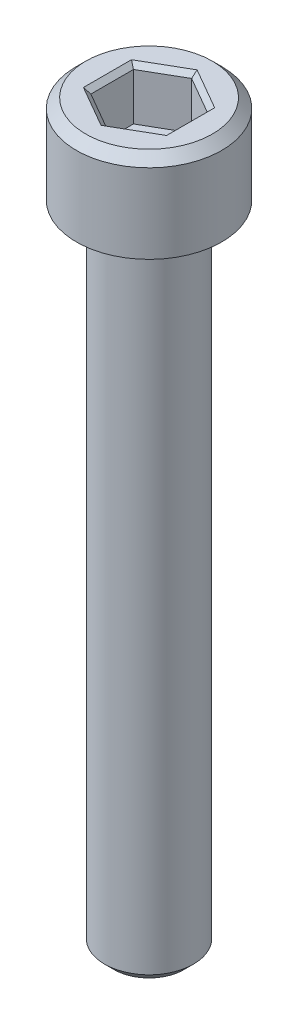
ISO-10303-21;
HEADER;
FILE_DESCRIPTION(('STEP AP214'),'2;1');
FILE_NAME('part.step','',(''),(''),'','','');
FILE_SCHEMA(('AUTOMOTIVE_DESIGN { 1 0 10303 214 1 1 1 1 }'));
ENDSEC;
DATA;
#1=APPLICATION_CONTEXT('core data for automotive mechanical design processes');
#2=APPLICATION_PROTOCOL_DEFINITION('international standard','automotive_design',2000,#1);
#3=PRODUCT_CONTEXT('',#1,'mechanical');
#4=PRODUCT('Part','Part','',(#3));
#5=PRODUCT_RELATED_PRODUCT_CATEGORY('part','',(#4));
#6=PRODUCT_DEFINITION_FORMATION('','',#4);
#7=PRODUCT_DEFINITION_CONTEXT('part definition',#1,'design');
#8=PRODUCT_DEFINITION('design','',#6,#7);
#9=PRODUCT_DEFINITION_SHAPE('','',#8);
#10=(LENGTH_UNIT() NAMED_UNIT(*) SI_UNIT(.MILLI.,.METRE.));
#11=(NAMED_UNIT(*) PLANE_ANGLE_UNIT() SI_UNIT($,.RADIAN.));
#12=(NAMED_UNIT(*) SI_UNIT($,.STERADIAN.) SOLID_ANGLE_UNIT());
#13=UNCERTAINTY_MEASURE_WITH_UNIT(LENGTH_MEASURE(1.E-05),#10,'distance_accuracy_value','');
#14=(GEOMETRIC_REPRESENTATION_CONTEXT(3) GLOBAL_UNCERTAINTY_ASSIGNED_CONTEXT((#13)) GLOBAL_UNIT_ASSIGNED_CONTEXT((#10,
#11,#12)) REPRESENTATION_CONTEXT('',''));
#15=CARTESIAN_POINT('',(0.,0.,0.));
#16=DIRECTION('',(0.,0.,1.));
#17=DIRECTION('',(1.,0.,0.));
#18=AXIS2_PLACEMENT_3D('',#15,#16,#17);
#19=CARTESIAN_POINT('',(-3.96874999999999,-2.794,0.));
#20=DIRECTION('',(0.,-1.,0.));
#21=DIRECTION('',(0.,0.,-1.));
#22=AXIS2_PLACEMENT_3D('',#19,#20,#21);
#23=PLANE('',#22);
#24=DIRECTION('',(-0.866025403784439,0.,0.5));
#25=VECTOR('',#24,1.);
#26=CARTESIAN_POINT('',(1.98437500000001,-2.794,1.14567944042317));
#27=LINE('',#26,#25);
#28=CARTESIAN_POINT('',(1.98437500000001,-2.794,1.14567944042317));
#29=VERTEX_POINT('',#28);
#30=CARTESIAN_POINT('',(0.,-2.794,2.29135888084634));
#31=VERTEX_POINT('',#30);
#32=EDGE_CURVE('E86',#29,#31,#27,.T.);
#33=ORIENTED_EDGE('',*,*,#32,.F.);
#34=DIRECTION('',(0.,0.,1.));
#35=VECTOR('',#34,1.);
#36=CARTESIAN_POINT('',(1.98437500000001,-2.794,-1.14567944042316));
#37=LINE('',#36,#35);
#38=CARTESIAN_POINT('',(1.98437500000001,-2.794,-1.14567944042316));
#39=VERTEX_POINT('',#38);
#40=EDGE_CURVE('E91',#39,#29,#37,.T.);
#41=ORIENTED_EDGE('',*,*,#40,.F.);
#42=DIRECTION('',(0.866025403784439,0.,0.5));
#43=VECTOR('',#42,1.);
#44=CARTESIAN_POINT('',(0.,-2.794,-2.29135888084632));
#45=LINE('',#44,#43);
#46=CARTESIAN_POINT('',(0.,-2.794,-2.29135888084632));
#47=VERTEX_POINT('',#46);
#48=EDGE_CURVE('E176',#47,#39,#45,.T.);
#49=ORIENTED_EDGE('',*,*,#48,.F.);
#50=DIRECTION('',(0.866025403784438,0.,-0.5));
#51=VECTOR('',#50,1.);
#52=CARTESIAN_POINT('',(-1.98437499999999,-2.794,-1.14567944042316));
#53=LINE('',#52,#51);
#54=CARTESIAN_POINT('',(-1.984375,-2.794,-1.14567944042316));
#55=VERTEX_POINT('',#54);
#56=EDGE_CURVE('E182',#55,#47,#53,.T.);
#57=ORIENTED_EDGE('',*,*,#56,.F.);
#58=DIRECTION('',(0.,0.,-1.));
#59=VECTOR('',#58,1.);
#60=CARTESIAN_POINT('',(-1.984375,-2.794,1.14567944042317));
#61=LINE('',#60,#59);
#62=CARTESIAN_POINT('',(-1.984375,-2.794,1.14567944042317));
#63=VERTEX_POINT('',#62);
#64=EDGE_CURVE('E187',#63,#55,#61,.T.);
#65=ORIENTED_EDGE('',*,*,#64,.F.);
#66=DIRECTION('',(-0.866025403784438,0.,-0.5));
#67=VECTOR('',#66,1.);
#68=CARTESIAN_POINT('',(0.,-2.794,2.29135888084634));
#69=LINE('',#68,#67);
#70=EDGE_CURVE('E102',#31,#63,#69,.T.);
#71=ORIENTED_EDGE('',*,*,#70,.F.);
#72=EDGE_LOOP('',(#33,#41,#49,#57,#65,#71));
#73=FACE_BOUND('',#72,.T.);
#74=ADVANCED_FACE('F17',(#73),#23,.F.);
#75=CARTESIAN_POINT('',(1.98437500000001,-2.794,-1.14567944042316));
#76=DIRECTION('',(-1.,0.,0.));
#77=DIRECTION('',(0.,0.,1.));
#78=AXIS2_PLACEMENT_3D('',#75,#76,#77);
#79=PLANE('',#78);
#80=DIRECTION('',(0.,1.,0.));
#81=VECTOR('',#80,1.);
#82=CARTESIAN_POINT('',(1.98437500000001,-2.794,-1.14567944042316));
#83=LINE('',#82,#81);
#84=CARTESIAN_POINT('',(1.98437500000001,-0.254,-1.14567944042316));
#85=VERTEX_POINT('',#84);
#86=EDGE_CURVE('E96',#39,#85,#83,.T.);
#87=ORIENTED_EDGE('',*,*,#86,.F.);
#88=ORIENTED_EDGE('',*,*,#40,.T.);
#89=DIRECTION('',(0.,1.,0.));
#90=VECTOR('',#89,1.);
#91=CARTESIAN_POINT('',(1.98437500000001,-2.794,1.14567944042317));
#92=LINE('',#91,#90);
#93=CARTESIAN_POINT('',(1.98437500000001,-0.254,1.14567944042317));
#94=VERTEX_POINT('',#93);
#95=EDGE_CURVE('E93',#94,#29,#92,.F.);
#96=ORIENTED_EDGE('',*,*,#95,.F.);
#97=DIRECTION('',(0.,0.,1.));
#98=VECTOR('',#97,1.);
#99=CARTESIAN_POINT('',(1.98437500000001,-0.254,0.));
#100=LINE('',#99,#98);
#101=EDGE_CURVE('E174',#94,#85,#100,.F.);
#102=ORIENTED_EDGE('',*,*,#101,.T.);
#103=EDGE_LOOP('',(#87,#88,#96,#102));
#104=FACE_BOUND('',#103,.T.);
#105=ADVANCED_FACE('F92',(#104),#79,.T.);
#106=CARTESIAN_POINT('',(1.98437500000001,-2.794,1.14567944042317));
#107=DIRECTION('',(-0.5,0.,-0.866025403784439));
#108=DIRECTION('',(-0.866025403784439,0.,0.5));
#109=AXIS2_PLACEMENT_3D('',#106,#107,#108);
#110=PLANE('',#109);
#111=ORIENTED_EDGE('',*,*,#95,.T.);
#112=ORIENTED_EDGE('',*,*,#32,.T.);
#113=DIRECTION('',(0.,1.,0.));
#114=VECTOR('',#113,1.);
#115=CARTESIAN_POINT('',(0.,-2.794,2.29135888084634));
#116=LINE('',#115,#114);
#117=CARTESIAN_POINT('',(0.,-0.253999999999999,2.29135888084634));
#118=VERTEX_POINT('',#117);
#119=EDGE_CURVE('E104',#118,#31,#116,.F.);
#120=ORIENTED_EDGE('',*,*,#119,.F.);
#121=DIRECTION('',(0.866025403784438,0.,-0.5));
#122=VECTOR('',#121,1.);
#123=CARTESIAN_POINT('',(0.,-0.253999999999998,2.29135888084634));
#124=LINE('',#123,#122);
#125=EDGE_CURVE('E108',#118,#94,#124,.T.);
#126=ORIENTED_EDGE('',*,*,#125,.T.);
#127=EDGE_LOOP('',(#111,#112,#120,#126));
#128=FACE_BOUND('',#127,.T.);
#129=ADVANCED_FACE('F106',(#128),#110,.T.);
#130=CARTESIAN_POINT('',(0.,-2.794,2.29135888084634));
#131=DIRECTION('',(0.5,0.,-0.866025403784438));
#132=DIRECTION('',(-0.866025403784438,0.,-0.5));
#133=AXIS2_PLACEMENT_3D('',#130,#131,#132);
#134=PLANE('',#133);
#135=ORIENTED_EDGE('',*,*,#119,.T.);
#136=ORIENTED_EDGE('',*,*,#70,.T.);
#137=DIRECTION('',(0.,1.,0.));
#138=VECTOR('',#137,1.);
#139=CARTESIAN_POINT('',(-1.984375,-2.794,1.14567944042317));
#140=LINE('',#139,#138);
#141=CARTESIAN_POINT('',(-1.984375,-0.254,1.14567944042317));
#142=VERTEX_POINT('',#141);
#143=EDGE_CURVE('E189',#142,#63,#140,.F.);
#144=ORIENTED_EDGE('',*,*,#143,.F.);
#145=DIRECTION('',(0.866025403784438,0.,0.500000000000001));
#146=VECTOR('',#145,1.);
#147=CARTESIAN_POINT('',(-1.984375,-0.254,1.14567944042317));
#148=LINE('',#147,#146);
#149=EDGE_CURVE('E168',#142,#118,#148,.T.);
#150=ORIENTED_EDGE('',*,*,#149,.T.);
#151=EDGE_LOOP('',(#135,#136,#144,#150));
#152=FACE_BOUND('',#151,.T.);
#153=ADVANCED_FACE('F193',(#152),#134,.T.);
#154=CARTESIAN_POINT('',(-1.984375,-2.794,1.14567944042317));
#155=DIRECTION('',(1.,0.,0.));
#156=DIRECTION('',(0.,0.,-1.));
#157=AXIS2_PLACEMENT_3D('',#154,#155,#156);
#158=PLANE('',#157);
#159=ORIENTED_EDGE('',*,*,#143,.T.);
#160=ORIENTED_EDGE('',*,*,#64,.T.);
#161=DIRECTION('',(0.,1.,0.));
#162=VECTOR('',#161,1.);
#163=CARTESIAN_POINT('',(-1.984375,-2.794,-1.14567944042316));
#164=LINE('',#163,#162);
#165=CARTESIAN_POINT('',(-1.984375,-0.253999999999999,-1.14567944042316));
#166=VERTEX_POINT('',#165);
#167=EDGE_CURVE('E184',#166,#55,#164,.F.);
#168=ORIENTED_EDGE('',*,*,#167,.F.);
#169=DIRECTION('',(0.,0.,1.));
#170=VECTOR('',#169,1.);
#171=CARTESIAN_POINT('',(-1.984375,-0.254,0.));
#172=LINE('',#171,#170);
#173=EDGE_CURVE('E163',#166,#142,#172,.T.);
#174=ORIENTED_EDGE('',*,*,#173,.T.);
#175=EDGE_LOOP('',(#159,#160,#168,#174));
#176=FACE_BOUND('',#175,.T.);
#177=ADVANCED_FACE('F224',(#176),#158,.T.);
#178=CARTESIAN_POINT('',(-1.98437499999999,-2.794,-1.14567944042316));
#179=DIRECTION('',(0.5,0.,0.866025403784438));
#180=DIRECTION('',(0.866025403784438,0.,-0.5));
#181=AXIS2_PLACEMENT_3D('',#178,#179,#180);
#182=PLANE('',#181);
#183=ORIENTED_EDGE('',*,*,#167,.T.);
#184=ORIENTED_EDGE('',*,*,#56,.T.);
#185=DIRECTION('',(0.,1.,0.));
#186=VECTOR('',#185,1.);
#187=CARTESIAN_POINT('',(0.,-2.794,-2.29135888084632));
#188=LINE('',#187,#186);
#189=CARTESIAN_POINT('',(0.,-0.254,-2.29135888084632));
#190=VERTEX_POINT('',#189);
#191=EDGE_CURVE('E178',#190,#47,#188,.F.);
#192=ORIENTED_EDGE('',*,*,#191,.F.);
#193=DIRECTION('',(-0.866025403784439,0.,0.499999999999999));
#194=VECTOR('',#193,1.);
#195=CARTESIAN_POINT('',(0.,-0.253999999999999,-2.29135888084632));
#196=LINE('',#195,#194);
#197=EDGE_CURVE('E158',#190,#166,#196,.T.);
#198=ORIENTED_EDGE('',*,*,#197,.T.);
#199=EDGE_LOOP('',(#183,#184,#192,#198));
#200=FACE_BOUND('',#199,.T.);
#201=ADVANCED_FACE('F220',(#200),#182,.T.);
#202=CARTESIAN_POINT('',(0.,-2.794,-2.29135888084632));
#203=DIRECTION('',(-0.5,0.,0.866025403784439));
#204=DIRECTION('',(0.866025403784439,0.,0.5));
#205=AXIS2_PLACEMENT_3D('',#202,#203,#204);
#206=PLANE('',#205);
#207=ORIENTED_EDGE('',*,*,#191,.T.);
#208=ORIENTED_EDGE('',*,*,#48,.T.);
#209=ORIENTED_EDGE('',*,*,#86,.T.);
#210=DIRECTION('',(-0.866025403784439,0.,-0.499999999999999));
#211=VECTOR('',#210,1.);
#212=CARTESIAN_POINT('',(1.98437500000001,-0.253999999999997,-1.14567944042316));
#213=LINE('',#212,#211);
#214=EDGE_CURVE('E150',#85,#190,#213,.T.);
#215=ORIENTED_EDGE('',*,*,#214,.T.);
#216=EDGE_LOOP('',(#207,#208,#209,#215));
#217=FACE_BOUND('',#216,.T.);
#218=ADVANCED_FACE('F215',(#217),#206,.T.);
#219=CARTESIAN_POINT('',(2.23837500000001,0.,0.));
#220=DIRECTION('',(0.707106781186548,-0.707106781186548,0.));
#221=DIRECTION('',(0.707106781186548,0.707106781186548,0.));
#222=AXIS2_PLACEMENT_3D('',#219,#220,#221);
#223=PLANE('',#222);
#224=ORIENTED_EDGE('',*,*,#101,.F.);
#225=DIRECTION('',(0.654653670707971,0.654653670707979,0.377964473009234));
#226=VECTOR('',#225,1.);
#227=CARTESIAN_POINT('',(1.98437500000001,-0.254,1.14567944042317));
#228=LINE('',#227,#226);
#229=CARTESIAN_POINT('',(2.23837500000001,0.,1.29232640879734));
#230=VERTEX_POINT('',#229);
#231=EDGE_CURVE('E171',#94,#230,#228,.T.);
#232=ORIENTED_EDGE('',*,*,#231,.T.);
#233=DIRECTION('',(0.,0.,1.));
#234=VECTOR('',#233,1.);
#235=CARTESIAN_POINT('',(2.23837500000001,0.,0.));
#236=LINE('',#235,#234);
#237=CARTESIAN_POINT('',(2.23837500000001,0.,-1.29232640879732));
#238=VERTEX_POINT('',#237);
#239=EDGE_CURVE('E146',#238,#230,#236,.T.);
#240=ORIENTED_EDGE('',*,*,#239,.F.);
#241=DIRECTION('',(-0.654653670707983,-0.654653670707975,0.377964473009221));
#242=VECTOR('',#241,1.);
#243=CARTESIAN_POINT('',(2.23837500000001,0.,-1.29232640879732));
#244=LINE('',#243,#242);
#245=EDGE_CURVE('E153',#238,#85,#244,.T.);
#246=ORIENTED_EDGE('',*,*,#245,.T.);
#247=EDGE_LOOP('',(#224,#232,#240,#246));
#248=FACE_BOUND('',#247,.T.);
#249=ADVANCED_FACE('F210',(#248),#223,.F.);
#250=CARTESIAN_POINT('',(1.11918750000001,0.,1.938489613196));
#251=DIRECTION('',(0.353553390593273,-0.707106781186548,0.612372435695794));
#252=DIRECTION('',(0.,-0.654653670707977,-0.755928946018455));
#253=AXIS2_PLACEMENT_3D('',#250,#251,#252);
#254=PLANE('',#253);
#255=ORIENTED_EDGE('',*,*,#125,.F.);
#256=DIRECTION('',(0.,-0.654653670707977,-0.755928946018455));
#257=VECTOR('',#256,1.);
#258=CARTESIAN_POINT('',(0.,-0.31976785714286,2.21541670079543));
#259=LINE('',#258,#257);
#260=CARTESIAN_POINT('',(0.,0.,2.58465281759467));
#261=VERTEX_POINT('',#260);
#262=EDGE_CURVE('E166',#118,#261,#259,.F.);
#263=ORIENTED_EDGE('',*,*,#262,.T.);
#264=DIRECTION('',(-0.866025403784439,0.,0.5));
#265=VECTOR('',#264,1.);
#266=CARTESIAN_POINT('',(2.23837500000001,0.,1.29232640879734));
#267=LINE('',#266,#265);
#268=EDGE_CURVE('E143',#230,#261,#267,.T.);
#269=ORIENTED_EDGE('',*,*,#268,.F.);
#270=ORIENTED_EDGE('',*,*,#231,.F.);
#271=EDGE_LOOP('',(#255,#263,#269,#270));
#272=FACE_BOUND('',#271,.T.);
#273=ADVANCED_FACE('F200',(#272),#254,.F.);
#274=CARTESIAN_POINT('',(-1.1191875,0.,1.938489613196));
#275=DIRECTION('',(-0.353553390593274,-0.707106781186548,0.612372435695794));
#276=DIRECTION('',(0.,-0.654653670707977,-0.755928946018455));
#277=AXIS2_PLACEMENT_3D('',#274,#275,#276);
#278=PLANE('',#277);
#279=DIRECTION('',(-0.866025403784437,0.,-0.500000000000002));
#280=VECTOR('',#279,1.);
#281=CARTESIAN_POINT('',(0.,0.,2.58465281759467));
#282=LINE('',#281,#280);
#283=CARTESIAN_POINT('',(-2.238375,0.,1.29232640879733));
#284=VERTEX_POINT('',#283);
#285=EDGE_CURVE('E140',#261,#284,#282,.T.);
#286=ORIENTED_EDGE('',*,*,#285,.F.);
#287=ORIENTED_EDGE('',*,*,#262,.F.);
#288=ORIENTED_EDGE('',*,*,#149,.F.);
#289=DIRECTION('',(-0.65465367070798,0.65465367070798,0.377964473009216));
#290=VECTOR('',#289,1.);
#291=CARTESIAN_POINT('',(-1.984375,-0.254,1.14567944042317));
#292=LINE('',#291,#290);
#293=EDGE_CURVE('E161',#142,#284,#292,.T.);
#294=ORIENTED_EDGE('',*,*,#293,.T.);
#295=EDGE_LOOP('',(#286,#287,#288,#294));
#296=FACE_BOUND('',#295,.T.);
#297=ADVANCED_FACE('F203',(#296),#278,.F.);
#298=CARTESIAN_POINT('',(-2.238375,0.,0.));
#299=DIRECTION('',(-0.707106781186548,-0.707106781186548,0.));
#300=DIRECTION('',(0.707106781186548,-0.707106781186548,0.));
#301=AXIS2_PLACEMENT_3D('',#298,#299,#300);
#302=PLANE('',#301);
#303=DIRECTION('',(0.,0.,1.));
#304=VECTOR('',#303,1.);
#305=CARTESIAN_POINT('',(-2.238375,0.,0.));
#306=LINE('',#305,#304);
#307=CARTESIAN_POINT('',(-2.238375,0.,-1.29232640879732));
#308=VERTEX_POINT('',#307);
#309=EDGE_CURVE('E137',#284,#308,#306,.F.);
#310=ORIENTED_EDGE('',*,*,#309,.F.);
#311=ORIENTED_EDGE('',*,*,#293,.F.);
#312=ORIENTED_EDGE('',*,*,#173,.F.);
#313=DIRECTION('',(-0.654653670707983,0.654653670707975,-0.377964473009222));
#314=VECTOR('',#313,1.);
#315=CARTESIAN_POINT('',(-1.984375,-0.253999999999995,-1.14567944042316));
#316=LINE('',#315,#314);
#317=EDGE_CURVE('E156',#166,#308,#316,.T.);
#318=ORIENTED_EDGE('',*,*,#317,.T.);
#319=EDGE_LOOP('',(#310,#311,#312,#318));
#320=FACE_BOUND('',#319,.T.);
#321=ADVANCED_FACE('F222',(#320),#302,.F.);
#322=CARTESIAN_POINT('',(-1.1191875,0.,-1.93848961319598));
#323=DIRECTION('',(-0.353553390593274,-0.707106781186548,-0.612372435695794));
#324=DIRECTION('',(0.,0.654653670707977,-0.755928946018455));
#325=AXIS2_PLACEMENT_3D('',#322,#323,#324);
#326=PLANE('',#325);
#327=ORIENTED_EDGE('',*,*,#197,.F.);
#328=DIRECTION('',(0.,0.654653670707977,-0.755928946018455));
#329=VECTOR('',#328,1.);
#330=CARTESIAN_POINT('',(0.,-0.319767857142856,-2.21541670079542));
#331=LINE('',#330,#329);
#332=CARTESIAN_POINT('',(0.,0.,-2.58465281759465));
#333=VERTEX_POINT('',#332);
#334=EDGE_CURVE('E35',#190,#333,#331,.T.);
#335=ORIENTED_EDGE('',*,*,#334,.T.);
#336=DIRECTION('',(0.866025403784439,0.,-0.499999999999999));
#337=VECTOR('',#336,1.);
#338=CARTESIAN_POINT('',(-2.238375,0.,-1.29232640879732));
#339=LINE('',#338,#337);
#340=EDGE_CURVE('E134',#308,#333,#339,.T.);
#341=ORIENTED_EDGE('',*,*,#340,.F.);
#342=ORIENTED_EDGE('',*,*,#317,.F.);
#343=EDGE_LOOP('',(#327,#335,#341,#342));
#344=FACE_BOUND('',#343,.T.);
#345=ADVANCED_FACE('F217',(#344),#326,.F.);
#346=CARTESIAN_POINT('',(1.1191875,0.,-1.93848961319599));
#347=DIRECTION('',(0.353553390593274,-0.707106781186548,-0.612372435695794));
#348=DIRECTION('',(0.,0.654653670707977,-0.755928946018455));
#349=AXIS2_PLACEMENT_3D('',#346,#347,#348);
#350=PLANE('',#349);
#351=ORIENTED_EDGE('',*,*,#214,.F.);
#352=ORIENTED_EDGE('',*,*,#245,.F.);
#353=DIRECTION('',(0.866025403784439,0.,0.5));
#354=VECTOR('',#353,1.);
#355=CARTESIAN_POINT('',(0.,0.,-2.58465281759465));
#356=LINE('',#355,#354);
#357=EDGE_CURVE('E125',#333,#238,#356,.T.);
#358=ORIENTED_EDGE('',*,*,#357,.F.);
#359=ORIENTED_EDGE('',*,*,#334,.F.);
#360=EDGE_LOOP('',(#351,#352,#358,#359));
#361=FACE_BOUND('',#360,.T.);
#362=ADVANCED_FACE('F213',(#361),#350,.F.);
#363=CARTESIAN_POINT('',(0.,0.,0.));
#364=DIRECTION('',(0.,1.,0.));
#365=DIRECTION('',(0.,0.,1.));
#366=AXIS2_PLACEMENT_3D('',#363,#364,#365);
#367=PLANE('',#366);
#368=ORIENTED_EDGE('',*,*,#340,.T.);
#369=ORIENTED_EDGE('',*,*,#357,.T.);
#370=ORIENTED_EDGE('',*,*,#239,.T.);
#371=ORIENTED_EDGE('',*,*,#268,.T.);
#372=ORIENTED_EDGE('',*,*,#285,.T.);
#373=ORIENTED_EDGE('',*,*,#309,.T.);
#374=EDGE_LOOP('',(#368,#369,#370,#371,#372,#373));
#375=FACE_BOUND('',#374,.T.);
#376=CARTESIAN_POINT('',(0.,5.6843418860808E-11,0.));
#377=DIRECTION('',(0.,-1.,0.));
#378=DIRECTION('',(0.,0.,-1.));
#379=AXIS2_PLACEMENT_3D('',#376,#377,#378);
#380=CIRCLE('',#379,3.40360000006967);
#381=CARTESIAN_POINT('',(0.,5.6843418860808E-11,-3.40360000006967));
#382=VERTEX_POINT('',#381);
#383=EDGE_CURVE('E20',#382,#382,#380,.T.);
#384=ORIENTED_EDGE('',*,*,#383,.F.);
#385=EDGE_LOOP('',(#384));
#386=FACE_BOUND('',#385,.T.);
#387=ADVANCED_FACE('F206',(#375,#386),#367,.T.);
#388=CARTESIAN_POINT('',(0.,-0.508000000365882,0.));
#389=DIRECTION('',(0.,-1.,0.));
#390=DIRECTION('',(0.,0.,-1.));
#391=AXIS2_PLACEMENT_3D('',#388,#389,#390);
#392=CONICAL_SURFACE('',#391,3.9115999995829,0.785398162502276);
#393=ORIENTED_EDGE('',*,*,#383,.T.);
#394=EDGE_LOOP('',(#393));
#395=FACE_BOUND('',#394,.T.);
#396=CARTESIAN_POINT('',(0.,-0.508,0.));
#397=DIRECTION('',(0.,-1.,0.));
#398=DIRECTION('',(0.,0.,-1.));
#399=AXIS2_PLACEMENT_3D('',#396,#397,#398);
#400=CIRCLE('',#399,3.9116);
#401=CARTESIAN_POINT('',(0.,-0.508,-3.9116));
#402=VERTEX_POINT('',#401);
#403=EDGE_CURVE('E117',#402,#402,#400,.T.);
#404=ORIENTED_EDGE('',*,*,#403,.F.);
#405=EDGE_LOOP('',(#404));
#406=FACE_BOUND('',#405,.T.);
#407=ADVANCED_FACE('F257',(#395,#406),#392,.T.);
#408=CARTESIAN_POINT('',(0.,-39.7002,0.));
#409=DIRECTION('',(0.,1.,0.));
#410=DIRECTION('',(0.,0.,1.));
#411=AXIS2_PLACEMENT_3D('',#408,#409,#410);
#412=PLANE('',#411);
#413=CARTESIAN_POINT('',(0.,-39.7002000005386,0.));
#414=DIRECTION('',(0.,1.,0.));
#415=DIRECTION('',(0.,0.,1.));
#416=AXIS2_PLACEMENT_3D('',#413,#414,#415);
#417=CIRCLE('',#416,1.87960000039311);
#418=CARTESIAN_POINT('',(0.,-39.7002000005386,1.87960000039311));
#419=VERTEX_POINT('',#418);
#420=EDGE_CURVE('E115',#419,#419,#417,.T.);
#421=ORIENTED_EDGE('',*,*,#420,.F.);
#422=EDGE_LOOP('',(#421));
#423=FACE_BOUND('',#422,.T.);
#424=ADVANCED_FACE('F253',(#423),#412,.F.);
#425=CARTESIAN_POINT('',(0.,-4.7752,0.));
#426=DIRECTION('',(0.,-1.,0.));
#427=DIRECTION('',(0.,0.,-1.));
#428=AXIS2_PLACEMENT_3D('',#425,#426,#427);
#429=CYLINDRICAL_SURFACE('',#428,3.9116);
#430=CARTESIAN_POINT('',(0.,-4.7752,0.));
#431=DIRECTION('',(0.,-1.,0.));
#432=DIRECTION('',(0.,0.,-1.));
#433=AXIS2_PLACEMENT_3D('',#430,#431,#432);
#434=CIRCLE('',#433,3.9116);
#435=CARTESIAN_POINT('',(0.,-4.7752,-3.9116));
#436=VERTEX_POINT('',#435);
#437=EDGE_CURVE('E113',#436,#436,#434,.F.);
#438=ORIENTED_EDGE('',*,*,#437,.T.);
#439=EDGE_LOOP('',(#438));
#440=FACE_BOUND('',#439,.T.);
#441=ORIENTED_EDGE('',*,*,#403,.T.);
#442=EDGE_LOOP('',(#441));
#443=FACE_BOUND('',#442,.T.);
#444=ADVANCED_FACE('F250',(#440,#443),#429,.T.);
#445=CARTESIAN_POINT('',(0.,-39.1922000001159,0.));
#446=DIRECTION('',(0.,1.,0.));
#447=DIRECTION('',(0.,0.,1.));
#448=AXIS2_PLACEMENT_3D('',#445,#446,#447);
#449=CONICAL_SURFACE('',#448,2.38759999996319,0.785398162558225);
#450=ORIENTED_EDGE('',*,*,#420,.T.);
#451=EDGE_LOOP('',(#450));
#452=FACE_BOUND('',#451,.T.);
#453=CARTESIAN_POINT('',(0.,-39.1922,0.));
#454=DIRECTION('',(0.,-1.,0.));
#455=DIRECTION('',(0.,0.,-1.));
#456=AXIS2_PLACEMENT_3D('',#453,#454,#455);
#457=CIRCLE('',#456,2.3876);
#458=CARTESIAN_POINT('',(0.,-39.1922,-2.3876));
#459=VERTEX_POINT('',#458);
#460=EDGE_CURVE('E26',#459,#459,#457,.F.);
#461=ORIENTED_EDGE('',*,*,#460,.F.);
#462=EDGE_LOOP('',(#461));
#463=FACE_BOUND('',#462,.T.);
#464=ADVANCED_FACE('F243',(#452,#463),#449,.T.);
#465=CARTESIAN_POINT('',(0.,-4.7752,0.));
#466=DIRECTION('',(0.,1.,0.));
#467=DIRECTION('',(0.,0.,1.));
#468=AXIS2_PLACEMENT_3D('',#465,#466,#467);
#469=PLANE('',#468);
#470=CARTESIAN_POINT('',(0.,-4.7752,0.));
#471=DIRECTION('',(0.,-1.,0.));
#472=DIRECTION('',(0.,0.,-1.));
#473=AXIS2_PLACEMENT_3D('',#470,#471,#472);
#474=CIRCLE('',#473,2.3876);
#475=CARTESIAN_POINT('',(0.,-4.7752,-2.3876));
#476=VERTEX_POINT('',#475);
#477=EDGE_CURVE('E11',#476,#476,#474,.T.);
#478=ORIENTED_EDGE('',*,*,#477,.F.);
#479=EDGE_LOOP('',(#478));
#480=FACE_BOUND('',#479,.T.);
#481=ORIENTED_EDGE('',*,*,#437,.F.);
#482=EDGE_LOOP('',(#481));
#483=FACE_BOUND('',#482,.T.);
#484=ADVANCED_FACE('F237',(#480,#483),#469,.F.);
#485=CARTESIAN_POINT('',(0.,-39.7002,0.));
#486=DIRECTION('',(0.,-1.,0.));
#487=DIRECTION('',(0.,0.,-1.));
#488=AXIS2_PLACEMENT_3D('',#485,#486,#487);
#489=CYLINDRICAL_SURFACE('',#488,2.3876);
#490=ORIENTED_EDGE('',*,*,#477,.T.);
#491=EDGE_LOOP('',(#490));
#492=FACE_BOUND('',#491,.T.);
#493=ORIENTED_EDGE('',*,*,#460,.T.);
#494=EDGE_LOOP('',(#493));
#495=FACE_BOUND('',#494,.T.);
#496=ADVANCED_FACE('F235',(#492,#495),#489,.T.);
#497=CLOSED_SHELL('',(#74,#105,#129,#153,#177,#201,#218,#249,#273,#297,#321,#345,#362,#387,#407,
#424,#444,#464,#484,#496));
#498=MANIFOLD_SOLID_BREP('B1',#497);
#499=ADVANCED_BREP_SHAPE_REPRESENTATION('',(#18,#498),#14);
#500=SHAPE_DEFINITION_REPRESENTATION(#9,#499);
ENDSEC;
END-ISO-10303-21;
